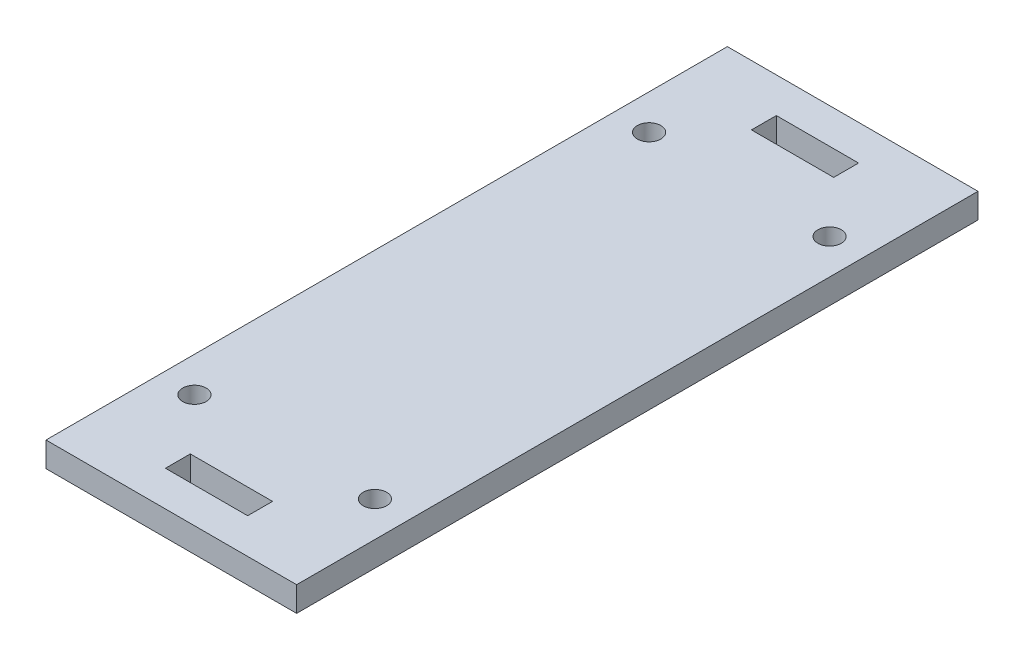
ISO-10303-21;
HEADER;
FILE_DESCRIPTION(('STEP AP214'),'2;1');
FILE_NAME('part.step','',(''),(''),'','','');
FILE_SCHEMA(('AUTOMOTIVE_DESIGN { 1 0 10303 214 1 1 1 1 }'));
ENDSEC;
DATA;
#1=APPLICATION_CONTEXT('core data for automotive mechanical design processes');
#2=APPLICATION_PROTOCOL_DEFINITION('international standard','automotive_design',2000,#1);
#3=PRODUCT_CONTEXT('',#1,'mechanical');
#4=PRODUCT('Part','Part','',(#3));
#5=PRODUCT_RELATED_PRODUCT_CATEGORY('part','',(#4));
#6=PRODUCT_DEFINITION_FORMATION('','',#4);
#7=PRODUCT_DEFINITION_CONTEXT('part definition',#1,'design');
#8=PRODUCT_DEFINITION('design','',#6,#7);
#9=PRODUCT_DEFINITION_SHAPE('','',#8);
#10=(LENGTH_UNIT() NAMED_UNIT(*) SI_UNIT(.MILLI.,.METRE.));
#11=(NAMED_UNIT(*) PLANE_ANGLE_UNIT() SI_UNIT($,.RADIAN.));
#12=(NAMED_UNIT(*) SI_UNIT($,.STERADIAN.) SOLID_ANGLE_UNIT());
#13=UNCERTAINTY_MEASURE_WITH_UNIT(LENGTH_MEASURE(1.E-05),#10,'distance_accuracy_value','');
#14=(GEOMETRIC_REPRESENTATION_CONTEXT(3) GLOBAL_UNCERTAINTY_ASSIGNED_CONTEXT((#13)) GLOBAL_UNIT_ASSIGNED_CONTEXT((#10,
#11,#12)) REPRESENTATION_CONTEXT('',''));
#15=CARTESIAN_POINT('',(0.,0.,0.));
#16=DIRECTION('',(0.,0.,1.));
#17=DIRECTION('',(1.,0.,0.));
#18=AXIS2_PLACEMENT_3D('',#15,#16,#17);
#19=CARTESIAN_POINT('',(0.,3.175,0.));
#20=DIRECTION('',(0.,-1.,0.));
#21=DIRECTION('',(0.,0.,-1.));
#22=AXIS2_PLACEMENT_3D('',#19,#20,#21);
#23=PLANE('',#22);
#24=DIRECTION('',(0.,0.,1.));
#25=VECTOR('',#24,1.);
#26=CARTESIAN_POINT('',(10.75,3.175,-7.675));
#27=LINE('',#26,#25);
#28=CARTESIAN_POINT('',(10.75,3.175,-7.675));
#29=VERTEX_POINT('',#28);
#30=CARTESIAN_POINT('',(10.75,3.175,-4.5));
#31=VERTEX_POINT('',#30);
#32=EDGE_CURVE('E162',#29,#31,#27,.T.);
#33=ORIENTED_EDGE('',*,*,#32,.F.);
#34=DIRECTION('',(-1.,0.,0.));
#35=VECTOR('',#34,1.);
#36=CARTESIAN_POINT('',(10.75,3.175,-7.675));
#37=LINE('',#36,#35);
#38=CARTESIAN_POINT('',(21.25,3.175,-7.675));
#39=VERTEX_POINT('',#38);
#40=EDGE_CURVE('E170',#39,#29,#37,.T.);
#41=ORIENTED_EDGE('',*,*,#40,.F.);
#42=DIRECTION('',(0.,0.,-1.));
#43=VECTOR('',#42,1.);
#44=CARTESIAN_POINT('',(21.25,3.175,-7.675));
#45=LINE('',#44,#43);
#46=CARTESIAN_POINT('',(21.25,3.175,-4.5));
#47=VERTEX_POINT('',#46);
#48=EDGE_CURVE('E167',#47,#39,#45,.T.);
#49=ORIENTED_EDGE('',*,*,#48,.F.);
#50=DIRECTION('',(1.,0.,0.));
#51=VECTOR('',#50,1.);
#52=CARTESIAN_POINT('',(10.75,3.175,-4.5));
#53=LINE('',#52,#51);
#54=EDGE_CURVE('E164',#31,#47,#53,.T.);
#55=ORIENTED_EDGE('',*,*,#54,.F.);
#56=EDGE_LOOP('',(#33,#41,#49,#55));
#57=FACE_BOUND('',#56,.T.);
#58=DIRECTION('',(0.,0.,1.));
#59=VECTOR('',#58,1.);
#60=CARTESIAN_POINT('',(0.,3.175,0.));
#61=LINE('',#60,#59);
#62=CARTESIAN_POINT('',(0.,3.175,-87.));
#63=VERTEX_POINT('',#62);
#64=CARTESIAN_POINT('',(0.,3.175,0.));
#65=VERTEX_POINT('',#64);
#66=EDGE_CURVE('E217',#63,#65,#61,.T.);
#67=ORIENTED_EDGE('',*,*,#66,.T.);
#68=DIRECTION('',(1.,0.,0.));
#69=VECTOR('',#68,1.);
#70=CARTESIAN_POINT('',(0.,3.175,0.));
#71=LINE('',#70,#69);
#72=CARTESIAN_POINT('',(32.,3.175,0.));
#73=VERTEX_POINT('',#72);
#74=EDGE_CURVE('E220',#65,#73,#71,.T.);
#75=ORIENTED_EDGE('',*,*,#74,.T.);
#76=DIRECTION('',(0.,0.,-1.));
#77=VECTOR('',#76,1.);
#78=CARTESIAN_POINT('',(32.,3.175,0.));
#79=LINE('',#78,#77);
#80=CARTESIAN_POINT('',(32.,3.175,-87.));
#81=VERTEX_POINT('',#80);
#82=EDGE_CURVE('E223',#73,#81,#79,.T.);
#83=ORIENTED_EDGE('',*,*,#82,.T.);
#84=DIRECTION('',(-1.,0.,0.));
#85=VECTOR('',#84,1.);
#86=CARTESIAN_POINT('',(0.,3.175,-87.));
#87=LINE('',#86,#85);
#88=EDGE_CURVE('E225',#81,#63,#87,.T.);
#89=ORIENTED_EDGE('',*,*,#88,.T.);
#90=EDGE_LOOP('',(#67,#75,#83,#89));
#91=FACE_BOUND('',#90,.T.);
#92=CARTESIAN_POINT('',(4.47500000000001,3.175,-72.525));
#93=DIRECTION('',(0.,1.,0.));
#94=DIRECTION('',(0.,0.,1.));
#95=AXIS2_PLACEMENT_3D('',#92,#93,#94);
#96=CIRCLE('',#95,1.5);
#97=CARTESIAN_POINT('',(4.47500000000001,3.175,-71.025));
#98=VERTEX_POINT('',#97);
#99=EDGE_CURVE('E211',#98,#98,#96,.T.);
#100=ORIENTED_EDGE('',*,*,#99,.F.);
#101=EDGE_LOOP('',(#100));
#102=FACE_BOUND('',#101,.T.);
#103=CARTESIAN_POINT('',(27.525,3.175,-72.525));
#104=DIRECTION('',(0.,1.,0.));
#105=DIRECTION('',(0.,0.,1.));
#106=AXIS2_PLACEMENT_3D('',#103,#104,#105);
#107=CIRCLE('',#106,1.5);
#108=CARTESIAN_POINT('',(27.525,3.175,-71.025));
#109=VERTEX_POINT('',#108);
#110=EDGE_CURVE('E205',#109,#109,#107,.T.);
#111=ORIENTED_EDGE('',*,*,#110,.F.);
#112=EDGE_LOOP('',(#111));
#113=FACE_BOUND('',#112,.T.);
#114=CARTESIAN_POINT('',(27.525,3.175,-14.475));
#115=DIRECTION('',(0.,1.,0.));
#116=DIRECTION('',(0.,0.,1.));
#117=AXIS2_PLACEMENT_3D('',#114,#115,#116);
#118=CIRCLE('',#117,1.5);
#119=CARTESIAN_POINT('',(27.525,3.175,-12.975));
#120=VERTEX_POINT('',#119);
#121=EDGE_CURVE('E199',#120,#120,#118,.T.);
#122=ORIENTED_EDGE('',*,*,#121,.F.);
#123=EDGE_LOOP('',(#122));
#124=FACE_BOUND('',#123,.T.);
#125=CARTESIAN_POINT('',(4.47500000000001,3.175,-14.475));
#126=DIRECTION('',(0.,1.,0.));
#127=DIRECTION('',(0.,0.,1.));
#128=AXIS2_PLACEMENT_3D('',#125,#126,#127);
#129=CIRCLE('',#128,1.5);
#130=CARTESIAN_POINT('',(4.47500000000001,3.175,-12.975));
#131=VERTEX_POINT('',#130);
#132=EDGE_CURVE('E193',#131,#131,#129,.T.);
#133=ORIENTED_EDGE('',*,*,#132,.F.);
#134=EDGE_LOOP('',(#133));
#135=FACE_BOUND('',#134,.T.);
#136=DIRECTION('',(0.,0.,1.));
#137=VECTOR('',#136,1.);
#138=CARTESIAN_POINT('',(10.75,3.175,-82.5));
#139=LINE('',#138,#137);
#140=CARTESIAN_POINT('',(10.75,3.175,-82.5));
#141=VERTEX_POINT('',#140);
#142=CARTESIAN_POINT('',(10.75,3.175,-79.325));
#143=VERTEX_POINT('',#142);
#144=EDGE_CURVE('E126',#141,#143,#139,.T.);
#145=ORIENTED_EDGE('',*,*,#144,.F.);
#146=DIRECTION('',(-1.,0.,0.));
#147=VECTOR('',#146,1.);
#148=CARTESIAN_POINT('',(10.75,3.175,-82.5));
#149=LINE('',#148,#147);
#150=CARTESIAN_POINT('',(21.25,3.175,-82.5));
#151=VERTEX_POINT('',#150);
#152=EDGE_CURVE('E148',#151,#141,#149,.T.);
#153=ORIENTED_EDGE('',*,*,#152,.F.);
#154=DIRECTION('',(0.,0.,-1.));
#155=VECTOR('',#154,1.);
#156=CARTESIAN_POINT('',(21.25,3.175,-82.5));
#157=LINE('',#156,#155);
#158=CARTESIAN_POINT('',(21.25,3.175,-79.325));
#159=VERTEX_POINT('',#158);
#160=EDGE_CURVE('E146',#159,#151,#157,.T.);
#161=ORIENTED_EDGE('',*,*,#160,.F.);
#162=DIRECTION('',(1.,0.,0.));
#163=VECTOR('',#162,1.);
#164=CARTESIAN_POINT('',(10.75,3.175,-79.325));
#165=LINE('',#164,#163);
#166=EDGE_CURVE('E134',#143,#159,#165,.T.);
#167=ORIENTED_EDGE('',*,*,#166,.F.);
#168=EDGE_LOOP('',(#145,#153,#161,#167));
#169=FACE_BOUND('',#168,.T.);
#170=ADVANCED_FACE('F37',(#57,#91,#102,#113,#124,#135,#169),#23,.F.);
#171=CARTESIAN_POINT('',(0.,0.,0.));
#172=DIRECTION('',(0.,-1.,0.));
#173=DIRECTION('',(0.,0.,-1.));
#174=AXIS2_PLACEMENT_3D('',#171,#172,#173);
#175=PLANE('',#174);
#176=CARTESIAN_POINT('',(27.525,0.,-14.475));
#177=DIRECTION('',(0.,1.,0.));
#178=DIRECTION('',(0.,0.,1.));
#179=AXIS2_PLACEMENT_3D('',#176,#177,#178);
#180=CIRCLE('',#179,1.5);
#181=CARTESIAN_POINT('',(27.525,0.,-12.975));
#182=VERTEX_POINT('',#181);
#183=EDGE_CURVE('E196',#182,#182,#180,.T.);
#184=ORIENTED_EDGE('',*,*,#183,.T.);
#185=EDGE_LOOP('',(#184));
#186=FACE_BOUND('',#185,.T.);
#187=CARTESIAN_POINT('',(4.47500000000001,0.,-72.525));
#188=DIRECTION('',(0.,1.,0.));
#189=DIRECTION('',(0.,0.,1.));
#190=AXIS2_PLACEMENT_3D('',#187,#188,#189);
#191=CIRCLE('',#190,1.5);
#192=CARTESIAN_POINT('',(4.47500000000001,0.,-71.025));
#193=VERTEX_POINT('',#192);
#194=EDGE_CURVE('E208',#193,#193,#191,.T.);
#195=ORIENTED_EDGE('',*,*,#194,.T.);
#196=EDGE_LOOP('',(#195));
#197=FACE_BOUND('',#196,.T.);
#198=DIRECTION('',(0.,0.,1.));
#199=VECTOR('',#198,1.);
#200=CARTESIAN_POINT('',(0.,0.,0.));
#201=LINE('',#200,#199);
#202=CARTESIAN_POINT('',(0.,0.,-87.));
#203=VERTEX_POINT('',#202);
#204=CARTESIAN_POINT('',(0.,0.,0.));
#205=VERTEX_POINT('',#204);
#206=EDGE_CURVE('E214',#203,#205,#201,.T.);
#207=ORIENTED_EDGE('',*,*,#206,.F.);
#208=DIRECTION('',(-1.,0.,0.));
#209=VECTOR('',#208,1.);
#210=CARTESIAN_POINT('',(0.,0.,-87.));
#211=LINE('',#210,#209);
#212=CARTESIAN_POINT('',(32.,0.,-87.));
#213=VERTEX_POINT('',#212);
#214=EDGE_CURVE('E221',#213,#203,#211,.T.);
#215=ORIENTED_EDGE('',*,*,#214,.F.);
#216=DIRECTION('',(0.,0.,-1.));
#217=VECTOR('',#216,1.);
#218=CARTESIAN_POINT('',(32.,0.,0.));
#219=LINE('',#218,#217);
#220=CARTESIAN_POINT('',(32.,0.,0.));
#221=VERTEX_POINT('',#220);
#222=EDGE_CURVE('E232',#221,#213,#219,.T.);
#223=ORIENTED_EDGE('',*,*,#222,.F.);
#224=DIRECTION('',(1.,0.,0.));
#225=VECTOR('',#224,1.);
#226=CARTESIAN_POINT('',(0.,0.,0.));
#227=LINE('',#226,#225);
#228=EDGE_CURVE('E230',#205,#221,#227,.T.);
#229=ORIENTED_EDGE('',*,*,#228,.F.);
#230=EDGE_LOOP('',(#207,#215,#223,#229));
#231=FACE_BOUND('',#230,.T.);
#232=CARTESIAN_POINT('',(27.525,0.,-72.525));
#233=DIRECTION('',(0.,1.,0.));
#234=DIRECTION('',(0.,0.,1.));
#235=AXIS2_PLACEMENT_3D('',#232,#233,#234);
#236=CIRCLE('',#235,1.5);
#237=CARTESIAN_POINT('',(27.525,0.,-71.025));
#238=VERTEX_POINT('',#237);
#239=EDGE_CURVE('E202',#238,#238,#236,.T.);
#240=ORIENTED_EDGE('',*,*,#239,.T.);
#241=EDGE_LOOP('',(#240));
#242=FACE_BOUND('',#241,.T.);
#243=CARTESIAN_POINT('',(4.47500000000001,0.,-14.475));
#244=DIRECTION('',(0.,1.,0.));
#245=DIRECTION('',(0.,0.,1.));
#246=AXIS2_PLACEMENT_3D('',#243,#244,#245);
#247=CIRCLE('',#246,1.5);
#248=CARTESIAN_POINT('',(4.47500000000001,0.,-12.975));
#249=VERTEX_POINT('',#248);
#250=EDGE_CURVE('E192',#249,#249,#247,.T.);
#251=ORIENTED_EDGE('',*,*,#250,.T.);
#252=EDGE_LOOP('',(#251));
#253=FACE_BOUND('',#252,.T.);
#254=DIRECTION('',(-1.,0.,0.));
#255=VECTOR('',#254,1.);
#256=CARTESIAN_POINT('',(10.75,0.,-7.675));
#257=LINE('',#256,#255);
#258=CARTESIAN_POINT('',(21.25,0.,-7.675));
#259=VERTEX_POINT('',#258);
#260=CARTESIAN_POINT('',(10.75,0.,-7.675));
#261=VERTEX_POINT('',#260);
#262=EDGE_CURVE('E165',#259,#261,#257,.T.);
#263=ORIENTED_EDGE('',*,*,#262,.T.);
#264=DIRECTION('',(0.,0.,1.));
#265=VECTOR('',#264,1.);
#266=CARTESIAN_POINT('',(10.75,0.,-7.675));
#267=LINE('',#266,#265);
#268=CARTESIAN_POINT('',(10.75,0.,-4.5));
#269=VERTEX_POINT('',#268);
#270=EDGE_CURVE('E142',#261,#269,#267,.T.);
#271=ORIENTED_EDGE('',*,*,#270,.T.);
#272=DIRECTION('',(1.,0.,0.));
#273=VECTOR('',#272,1.);
#274=CARTESIAN_POINT('',(10.75,0.,-4.5));
#275=LINE('',#274,#273);
#276=CARTESIAN_POINT('',(21.25,0.,-4.5));
#277=VERTEX_POINT('',#276);
#278=EDGE_CURVE('E175',#269,#277,#275,.T.);
#279=ORIENTED_EDGE('',*,*,#278,.T.);
#280=DIRECTION('',(0.,0.,-1.));
#281=VECTOR('',#280,1.);
#282=CARTESIAN_POINT('',(21.25,0.,-7.675));
#283=LINE('',#282,#281);
#284=EDGE_CURVE('E178',#277,#259,#283,.T.);
#285=ORIENTED_EDGE('',*,*,#284,.T.);
#286=EDGE_LOOP('',(#263,#271,#279,#285));
#287=FACE_BOUND('',#286,.T.);
#288=DIRECTION('',(-1.,0.,0.));
#289=VECTOR('',#288,1.);
#290=CARTESIAN_POINT('',(10.75,0.,-82.5));
#291=LINE('',#290,#289);
#292=CARTESIAN_POINT('',(21.25,0.,-82.5));
#293=VERTEX_POINT('',#292);
#294=CARTESIAN_POINT('',(10.75,0.,-82.5));
#295=VERTEX_POINT('',#294);
#296=EDGE_CURVE('E135',#293,#295,#291,.T.);
#297=ORIENTED_EDGE('',*,*,#296,.T.);
#298=DIRECTION('',(0.,0.,1.));
#299=VECTOR('',#298,1.);
#300=CARTESIAN_POINT('',(10.75,0.,-82.5));
#301=LINE('',#300,#299);
#302=CARTESIAN_POINT('',(10.75,0.,-79.325));
#303=VERTEX_POINT('',#302);
#304=EDGE_CURVE('E60',#295,#303,#301,.T.);
#305=ORIENTED_EDGE('',*,*,#304,.T.);
#306=DIRECTION('',(1.,0.,0.));
#307=VECTOR('',#306,1.);
#308=CARTESIAN_POINT('',(10.75,0.,-79.325));
#309=LINE('',#308,#307);
#310=CARTESIAN_POINT('',(21.25,0.,-79.325));
#311=VERTEX_POINT('',#310);
#312=EDGE_CURVE('E141',#303,#311,#309,.T.);
#313=ORIENTED_EDGE('',*,*,#312,.T.);
#314=DIRECTION('',(0.,0.,-1.));
#315=VECTOR('',#314,1.);
#316=CARTESIAN_POINT('',(21.25,0.,-82.5));
#317=LINE('',#316,#315);
#318=EDGE_CURVE('E154',#311,#293,#317,.T.);
#319=ORIENTED_EDGE('',*,*,#318,.T.);
#320=EDGE_LOOP('',(#297,#305,#313,#319));
#321=FACE_BOUND('',#320,.T.);
#322=ADVANCED_FACE('F250',(#186,#197,#231,#242,#253,#287,#321),#175,.T.);
#323=CARTESIAN_POINT('',(0.,3.175,0.));
#324=DIRECTION('',(1.,0.,0.));
#325=DIRECTION('',(0.,0.,-1.));
#326=AXIS2_PLACEMENT_3D('',#323,#324,#325);
#327=PLANE('',#326);
#328=ORIENTED_EDGE('',*,*,#206,.T.);
#329=DIRECTION('',(0.,-1.,0.));
#330=VECTOR('',#329,1.);
#331=CARTESIAN_POINT('',(0.,3.175,0.));
#332=LINE('',#331,#330);
#333=EDGE_CURVE('E11',#65,#205,#332,.T.);
#334=ORIENTED_EDGE('',*,*,#333,.F.);
#335=ORIENTED_EDGE('',*,*,#66,.F.);
#336=DIRECTION('',(0.,-1.,0.));
#337=VECTOR('',#336,1.);
#338=CARTESIAN_POINT('',(0.,3.175,-87.));
#339=LINE('',#338,#337);
#340=EDGE_CURVE('E227',#63,#203,#339,.T.);
#341=ORIENTED_EDGE('',*,*,#340,.T.);
#342=EDGE_LOOP('',(#328,#334,#335,#341));
#343=FACE_BOUND('',#342,.T.);
#344=ADVANCED_FACE('F39',(#343),#327,.F.);
#345=CARTESIAN_POINT('',(0.,3.175,0.));
#346=DIRECTION('',(0.,0.,-1.));
#347=DIRECTION('',(-1.,0.,0.));
#348=AXIS2_PLACEMENT_3D('',#345,#346,#347);
#349=PLANE('',#348);
#350=ORIENTED_EDGE('',*,*,#228,.T.);
#351=DIRECTION('',(0.,-1.,0.));
#352=VECTOR('',#351,1.);
#353=CARTESIAN_POINT('',(32.,3.175,0.));
#354=LINE('',#353,#352);
#355=EDGE_CURVE('E45',#73,#221,#354,.T.);
#356=ORIENTED_EDGE('',*,*,#355,.F.);
#357=ORIENTED_EDGE('',*,*,#74,.F.);
#358=ORIENTED_EDGE('',*,*,#333,.T.);
#359=EDGE_LOOP('',(#350,#356,#357,#358));
#360=FACE_BOUND('',#359,.T.);
#361=ADVANCED_FACE('F261',(#360),#349,.F.);
#362=CARTESIAN_POINT('',(32.,3.175,0.));
#363=DIRECTION('',(-1.,0.,0.));
#364=DIRECTION('',(0.,0.,1.));
#365=AXIS2_PLACEMENT_3D('',#362,#363,#364);
#366=PLANE('',#365);
#367=ORIENTED_EDGE('',*,*,#222,.T.);
#368=DIRECTION('',(0.,-1.,0.));
#369=VECTOR('',#368,1.);
#370=CARTESIAN_POINT('',(32.,3.175,-87.));
#371=LINE('',#370,#369);
#372=EDGE_CURVE('E237',#81,#213,#371,.T.);
#373=ORIENTED_EDGE('',*,*,#372,.F.);
#374=ORIENTED_EDGE('',*,*,#82,.F.);
#375=ORIENTED_EDGE('',*,*,#355,.T.);
#376=EDGE_LOOP('',(#367,#373,#374,#375));
#377=FACE_BOUND('',#376,.T.);
#378=ADVANCED_FACE('F244',(#377),#366,.F.);
#379=CARTESIAN_POINT('',(0.,3.175,-87.));
#380=DIRECTION('',(0.,0.,1.));
#381=DIRECTION('',(1.,0.,0.));
#382=AXIS2_PLACEMENT_3D('',#379,#380,#381);
#383=PLANE('',#382);
#384=ORIENTED_EDGE('',*,*,#214,.T.);
#385=ORIENTED_EDGE('',*,*,#340,.F.);
#386=ORIENTED_EDGE('',*,*,#88,.F.);
#387=ORIENTED_EDGE('',*,*,#372,.T.);
#388=EDGE_LOOP('',(#384,#385,#386,#387));
#389=FACE_BOUND('',#388,.T.);
#390=ADVANCED_FACE('F254',(#389),#383,.F.);
#391=CARTESIAN_POINT('',(4.47500000000001,3.175,-72.525));
#392=DIRECTION('',(0.,-1.,0.));
#393=DIRECTION('',(0.,0.,-1.));
#394=AXIS2_PLACEMENT_3D('',#391,#392,#393);
#395=CYLINDRICAL_SURFACE('',#394,1.5);
#396=ORIENTED_EDGE('',*,*,#99,.T.);
#397=EDGE_LOOP('',(#396));
#398=FACE_BOUND('',#397,.T.);
#399=ORIENTED_EDGE('',*,*,#194,.F.);
#400=EDGE_LOOP('',(#399));
#401=FACE_BOUND('',#400,.T.);
#402=ADVANCED_FACE('F278',(#398,#401),#395,.F.);
#403=CARTESIAN_POINT('',(27.525,3.175,-72.525));
#404=DIRECTION('',(0.,-1.,0.));
#405=DIRECTION('',(0.,0.,-1.));
#406=AXIS2_PLACEMENT_3D('',#403,#404,#405);
#407=CYLINDRICAL_SURFACE('',#406,1.5);
#408=ORIENTED_EDGE('',*,*,#110,.T.);
#409=EDGE_LOOP('',(#408));
#410=FACE_BOUND('',#409,.T.);
#411=ORIENTED_EDGE('',*,*,#239,.F.);
#412=EDGE_LOOP('',(#411));
#413=FACE_BOUND('',#412,.T.);
#414=ADVANCED_FACE('F285',(#410,#413),#407,.F.);
#415=CARTESIAN_POINT('',(27.525,3.175,-14.475));
#416=DIRECTION('',(0.,-1.,0.));
#417=DIRECTION('',(0.,0.,-1.));
#418=AXIS2_PLACEMENT_3D('',#415,#416,#417);
#419=CYLINDRICAL_SURFACE('',#418,1.5);
#420=ORIENTED_EDGE('',*,*,#121,.T.);
#421=EDGE_LOOP('',(#420));
#422=FACE_BOUND('',#421,.T.);
#423=ORIENTED_EDGE('',*,*,#183,.F.);
#424=EDGE_LOOP('',(#423));
#425=FACE_BOUND('',#424,.T.);
#426=ADVANCED_FACE('F290',(#422,#425),#419,.F.);
#427=CARTESIAN_POINT('',(4.47500000000001,3.175,-14.475));
#428=DIRECTION('',(0.,-1.,0.));
#429=DIRECTION('',(0.,0.,-1.));
#430=AXIS2_PLACEMENT_3D('',#427,#428,#429);
#431=CYLINDRICAL_SURFACE('',#430,1.5);
#432=ORIENTED_EDGE('',*,*,#132,.T.);
#433=EDGE_LOOP('',(#432));
#434=FACE_BOUND('',#433,.T.);
#435=ORIENTED_EDGE('',*,*,#250,.F.);
#436=EDGE_LOOP('',(#435));
#437=FACE_BOUND('',#436,.T.);
#438=ADVANCED_FACE('F303',(#434,#437),#431,.F.);
#439=CARTESIAN_POINT('',(10.75,3.175,-7.675));
#440=DIRECTION('',(1.,0.,0.));
#441=DIRECTION('',(0.,0.,-1.));
#442=AXIS2_PLACEMENT_3D('',#439,#440,#441);
#443=PLANE('',#442);
#444=ORIENTED_EDGE('',*,*,#270,.F.);
#445=DIRECTION('',(0.,-1.,0.));
#446=VECTOR('',#445,1.);
#447=CARTESIAN_POINT('',(10.75,3.175,-7.675));
#448=LINE('',#447,#446);
#449=EDGE_CURVE('E172',#29,#261,#448,.T.);
#450=ORIENTED_EDGE('',*,*,#449,.F.);
#451=ORIENTED_EDGE('',*,*,#32,.T.);
#452=DIRECTION('',(0.,-1.,0.));
#453=VECTOR('',#452,1.);
#454=CARTESIAN_POINT('',(10.75,3.175,-4.5));
#455=LINE('',#454,#453);
#456=EDGE_CURVE('E189',#31,#269,#455,.T.);
#457=ORIENTED_EDGE('',*,*,#456,.T.);
#458=EDGE_LOOP('',(#444,#450,#451,#457));
#459=FACE_BOUND('',#458,.T.);
#460=ADVANCED_FACE('F306',(#459),#443,.T.);
#461=CARTESIAN_POINT('',(10.75,3.175,-4.5));
#462=DIRECTION('',(0.,0.,-1.));
#463=DIRECTION('',(-1.,0.,0.));
#464=AXIS2_PLACEMENT_3D('',#461,#462,#463);
#465=PLANE('',#464);
#466=ORIENTED_EDGE('',*,*,#278,.F.);
#467=ORIENTED_EDGE('',*,*,#456,.F.);
#468=ORIENTED_EDGE('',*,*,#54,.T.);
#469=DIRECTION('',(0.,-1.,0.));
#470=VECTOR('',#469,1.);
#471=CARTESIAN_POINT('',(21.25,3.175,-4.5));
#472=LINE('',#471,#470);
#473=EDGE_CURVE('E187',#47,#277,#472,.T.);
#474=ORIENTED_EDGE('',*,*,#473,.T.);
#475=EDGE_LOOP('',(#466,#467,#468,#474));
#476=FACE_BOUND('',#475,.T.);
#477=ADVANCED_FACE('F335',(#476),#465,.T.);
#478=CARTESIAN_POINT('',(21.25,3.175,-7.675));
#479=DIRECTION('',(-1.,0.,0.));
#480=DIRECTION('',(0.,0.,1.));
#481=AXIS2_PLACEMENT_3D('',#478,#479,#480);
#482=PLANE('',#481);
#483=ORIENTED_EDGE('',*,*,#284,.F.);
#484=ORIENTED_EDGE('',*,*,#473,.F.);
#485=ORIENTED_EDGE('',*,*,#48,.T.);
#486=DIRECTION('',(0.,-1.,0.));
#487=VECTOR('',#486,1.);
#488=CARTESIAN_POINT('',(21.25,3.175,-7.675));
#489=LINE('',#488,#487);
#490=EDGE_CURVE('E185',#39,#259,#489,.T.);
#491=ORIENTED_EDGE('',*,*,#490,.T.);
#492=EDGE_LOOP('',(#483,#484,#485,#491));
#493=FACE_BOUND('',#492,.T.);
#494=ADVANCED_FACE('F331',(#493),#482,.T.);
#495=CARTESIAN_POINT('',(10.75,3.175,-7.675));
#496=DIRECTION('',(0.,0.,1.));
#497=DIRECTION('',(1.,0.,0.));
#498=AXIS2_PLACEMENT_3D('',#495,#496,#497);
#499=PLANE('',#498);
#500=ORIENTED_EDGE('',*,*,#262,.F.);
#501=ORIENTED_EDGE('',*,*,#490,.F.);
#502=ORIENTED_EDGE('',*,*,#40,.T.);
#503=ORIENTED_EDGE('',*,*,#449,.T.);
#504=EDGE_LOOP('',(#500,#501,#502,#503));
#505=FACE_BOUND('',#504,.T.);
#506=ADVANCED_FACE('F328',(#505),#499,.T.);
#507=CARTESIAN_POINT('',(10.75,3.175,-82.5));
#508=DIRECTION('',(1.,0.,0.));
#509=DIRECTION('',(0.,0.,-1.));
#510=AXIS2_PLACEMENT_3D('',#507,#508,#509);
#511=PLANE('',#510);
#512=ORIENTED_EDGE('',*,*,#304,.F.);
#513=DIRECTION('',(0.,-1.,0.));
#514=VECTOR('',#513,1.);
#515=CARTESIAN_POINT('',(10.75,3.175,-82.5));
#516=LINE('',#515,#514);
#517=EDGE_CURVE('E130',#141,#295,#516,.T.);
#518=ORIENTED_EDGE('',*,*,#517,.F.);
#519=ORIENTED_EDGE('',*,*,#144,.T.);
#520=DIRECTION('',(0.,-1.,0.));
#521=VECTOR('',#520,1.);
#522=CARTESIAN_POINT('',(10.75,3.175,-79.325));
#523=LINE('',#522,#521);
#524=EDGE_CURVE('E129',#143,#303,#523,.T.);
#525=ORIENTED_EDGE('',*,*,#524,.T.);
#526=EDGE_LOOP('',(#512,#518,#519,#525));
#527=FACE_BOUND('',#526,.T.);
#528=ADVANCED_FACE('F128',(#527),#511,.T.);
#529=CARTESIAN_POINT('',(10.75,3.175,-79.325));
#530=DIRECTION('',(0.,0.,-1.));
#531=DIRECTION('',(-1.,0.,0.));
#532=AXIS2_PLACEMENT_3D('',#529,#530,#531);
#533=PLANE('',#532);
#534=ORIENTED_EDGE('',*,*,#312,.F.);
#535=ORIENTED_EDGE('',*,*,#524,.F.);
#536=ORIENTED_EDGE('',*,*,#166,.T.);
#537=DIRECTION('',(0.,-1.,0.));
#538=VECTOR('',#537,1.);
#539=CARTESIAN_POINT('',(21.25,3.175,-79.325));
#540=LINE('',#539,#538);
#541=EDGE_CURVE('E143',#159,#311,#540,.T.);
#542=ORIENTED_EDGE('',*,*,#541,.T.);
#543=EDGE_LOOP('',(#534,#535,#536,#542));
#544=FACE_BOUND('',#543,.T.);
#545=ADVANCED_FACE('F138',(#544),#533,.T.);
#546=CARTESIAN_POINT('',(21.25,3.175,-82.5));
#547=DIRECTION('',(-1.,0.,0.));
#548=DIRECTION('',(0.,0.,1.));
#549=AXIS2_PLACEMENT_3D('',#546,#547,#548);
#550=PLANE('',#549);
#551=ORIENTED_EDGE('',*,*,#318,.F.);
#552=ORIENTED_EDGE('',*,*,#541,.F.);
#553=ORIENTED_EDGE('',*,*,#160,.T.);
#554=DIRECTION('',(0.,-1.,0.));
#555=VECTOR('',#554,1.);
#556=CARTESIAN_POINT('',(21.25,3.175,-82.5));
#557=LINE('',#556,#555);
#558=EDGE_CURVE('E52',#151,#293,#557,.T.);
#559=ORIENTED_EDGE('',*,*,#558,.T.);
#560=EDGE_LOOP('',(#551,#552,#553,#559));
#561=FACE_BOUND('',#560,.T.);
#562=ADVANCED_FACE('F316',(#561),#550,.T.);
#563=CARTESIAN_POINT('',(10.75,3.175,-82.5));
#564=DIRECTION('',(0.,0.,1.));
#565=DIRECTION('',(1.,0.,0.));
#566=AXIS2_PLACEMENT_3D('',#563,#564,#565);
#567=PLANE('',#566);
#568=ORIENTED_EDGE('',*,*,#296,.F.);
#569=ORIENTED_EDGE('',*,*,#558,.F.);
#570=ORIENTED_EDGE('',*,*,#152,.T.);
#571=ORIENTED_EDGE('',*,*,#517,.T.);
#572=EDGE_LOOP('',(#568,#569,#570,#571));
#573=FACE_BOUND('',#572,.T.);
#574=ADVANCED_FACE('F314',(#573),#567,.T.);
#575=CLOSED_SHELL('',(#170,#322,#344,#361,#378,#390,#402,#414,#426,#438,#460,#477,#494,#506,
#528,#545,#562,#574));
#576=MANIFOLD_SOLID_BREP('B2',#575);
#577=ADVANCED_BREP_SHAPE_REPRESENTATION('',(#18,#576),#14);
#578=SHAPE_DEFINITION_REPRESENTATION(#9,#577);
ENDSEC;
END-ISO-10303-21;
